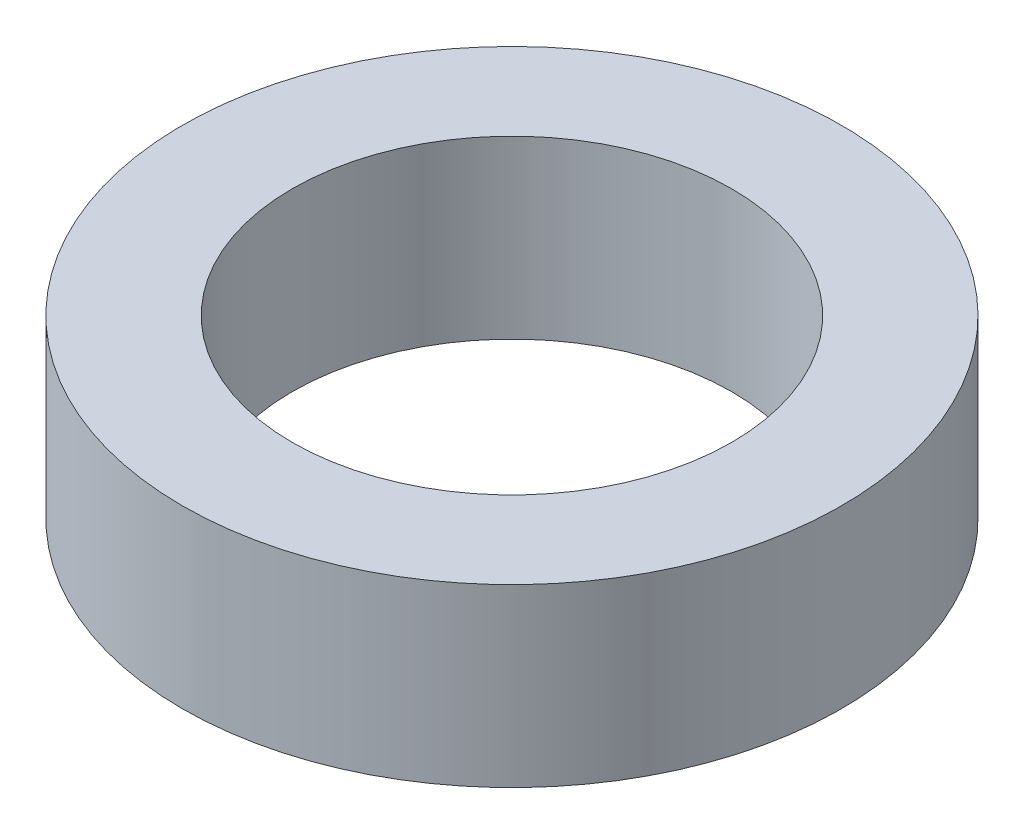
ISO-10303-21;
HEADER;
FILE_DESCRIPTION(('STEP AP214'),'2;1');
FILE_NAME('part.step','',(''),(''),'','','');
FILE_SCHEMA(('AUTOMOTIVE_DESIGN { 1 0 10303 214 1 1 1 1 }'));
ENDSEC;
DATA;
#1=APPLICATION_CONTEXT('core data for automotive mechanical design processes');
#2=APPLICATION_PROTOCOL_DEFINITION('international standard','automotive_design',2000,#1);
#3=PRODUCT_CONTEXT('',#1,'mechanical');
#4=PRODUCT('Part','Part','',(#3));
#5=PRODUCT_RELATED_PRODUCT_CATEGORY('part','',(#4));
#6=PRODUCT_DEFINITION_FORMATION('','',#4);
#7=PRODUCT_DEFINITION_CONTEXT('part definition',#1,'design');
#8=PRODUCT_DEFINITION('design','',#6,#7);
#9=PRODUCT_DEFINITION_SHAPE('','',#8);
#10=(LENGTH_UNIT() NAMED_UNIT(*) SI_UNIT(.MILLI.,.METRE.));
#11=(NAMED_UNIT(*) PLANE_ANGLE_UNIT() SI_UNIT($,.RADIAN.));
#12=(NAMED_UNIT(*) SI_UNIT($,.STERADIAN.) SOLID_ANGLE_UNIT());
#13=UNCERTAINTY_MEASURE_WITH_UNIT(LENGTH_MEASURE(1.E-05),#10,'distance_accuracy_value','');
#14=(GEOMETRIC_REPRESENTATION_CONTEXT(3) GLOBAL_UNCERTAINTY_ASSIGNED_CONTEXT((#13)) GLOBAL_UNIT_ASSIGNED_CONTEXT((#10,
#11,#12)) REPRESENTATION_CONTEXT('',''));
#15=CARTESIAN_POINT('',(0.,0.,0.));
#16=DIRECTION('',(0.,0.,1.));
#17=DIRECTION('',(1.,0.,0.));
#18=AXIS2_PLACEMENT_3D('',#15,#16,#17);
#19=CARTESIAN_POINT('',(0.,2.54,0.));
#20=DIRECTION('',(0.,1.,0.));
#21=DIRECTION('',(0.,0.,1.));
#22=AXIS2_PLACEMENT_3D('',#19,#20,#21);
#23=PLANE('',#22);
#24=CARTESIAN_POINT('',(0.,2.54,0.));
#25=DIRECTION('',(0.,1.,0.));
#26=DIRECTION('',(0.,0.,1.));
#27=AXIS2_PLACEMENT_3D('',#24,#25,#26);
#28=CIRCLE('',#27,4.7625);
#29=CARTESIAN_POINT('',(0.,2.54,4.7625));
#30=VERTEX_POINT('',#29);
#31=EDGE_CURVE('E10',#30,#30,#28,.T.);
#32=ORIENTED_EDGE('',*,*,#31,.T.);
#33=EDGE_LOOP('',(#32));
#34=FACE_BOUND('',#33,.T.);
#35=CARTESIAN_POINT('',(0.,2.54,0.));
#36=DIRECTION('',(0.,1.,0.));
#37=DIRECTION('',(0.,0.,1.));
#38=AXIS2_PLACEMENT_3D('',#35,#36,#37);
#39=CIRCLE('',#38,3.175);
#40=CARTESIAN_POINT('',(0.,2.54,3.175));
#41=VERTEX_POINT('',#40);
#42=EDGE_CURVE('E42',#41,#41,#39,.T.);
#43=ORIENTED_EDGE('',*,*,#42,.F.);
#44=EDGE_LOOP('',(#43));
#45=FACE_BOUND('',#44,.T.);
#46=ADVANCED_FACE('F31',(#34,#45),#23,.T.);
#47=CARTESIAN_POINT('',(0.,0.,0.));
#48=DIRECTION('',(0.,1.,0.));
#49=DIRECTION('',(0.,0.,1.));
#50=AXIS2_PLACEMENT_3D('',#47,#48,#49);
#51=PLANE('',#50);
#52=CARTESIAN_POINT('',(0.,0.,0.));
#53=DIRECTION('',(0.,1.,0.));
#54=DIRECTION('',(0.,0.,1.));
#55=AXIS2_PLACEMENT_3D('',#52,#53,#54);
#56=CIRCLE('',#55,4.7625);
#57=CARTESIAN_POINT('',(0.,0.,4.7625));
#58=VERTEX_POINT('',#57);
#59=EDGE_CURVE('E35',#58,#58,#56,.T.);
#60=ORIENTED_EDGE('',*,*,#59,.F.);
#61=EDGE_LOOP('',(#60));
#62=FACE_BOUND('',#61,.T.);
#63=CARTESIAN_POINT('',(0.,0.,0.));
#64=DIRECTION('',(0.,1.,0.));
#65=DIRECTION('',(0.,0.,1.));
#66=AXIS2_PLACEMENT_3D('',#63,#64,#65);
#67=CIRCLE('',#66,3.175);
#68=CARTESIAN_POINT('',(0.,0.,3.175));
#69=VERTEX_POINT('',#68);
#70=EDGE_CURVE('E44',#69,#69,#67,.T.);
#71=ORIENTED_EDGE('',*,*,#70,.T.);
#72=EDGE_LOOP('',(#71));
#73=FACE_BOUND('',#72,.T.);
#74=ADVANCED_FACE('F54',(#62,#73),#51,.F.);
#75=CARTESIAN_POINT('',(0.,2.54,0.));
#76=DIRECTION('',(0.,-1.,0.));
#77=DIRECTION('',(0.,0.,-1.));
#78=AXIS2_PLACEMENT_3D('',#75,#76,#77);
#79=CYLINDRICAL_SURFACE('',#78,4.7625);
#80=ORIENTED_EDGE('',*,*,#31,.F.);
#81=EDGE_LOOP('',(#80));
#82=FACE_BOUND('',#81,.T.);
#83=ORIENTED_EDGE('',*,*,#59,.T.);
#84=EDGE_LOOP('',(#83));
#85=FACE_BOUND('',#84,.T.);
#86=ADVANCED_FACE('F33',(#82,#85),#79,.T.);
#87=CARTESIAN_POINT('',(0.,2.54,0.));
#88=DIRECTION('',(0.,-1.,0.));
#89=DIRECTION('',(0.,0.,-1.));
#90=AXIS2_PLACEMENT_3D('',#87,#88,#89);
#91=CYLINDRICAL_SURFACE('',#90,3.175);
#92=ORIENTED_EDGE('',*,*,#42,.T.);
#93=EDGE_LOOP('',(#92));
#94=FACE_BOUND('',#93,.T.);
#95=ORIENTED_EDGE('',*,*,#70,.F.);
#96=EDGE_LOOP('',(#95));
#97=FACE_BOUND('',#96,.T.);
#98=ADVANCED_FACE('F50',(#94,#97),#91,.F.);
#99=CLOSED_SHELL('',(#46,#74,#86,#98));
#100=MANIFOLD_SOLID_BREP('B2',#99);
#101=ADVANCED_BREP_SHAPE_REPRESENTATION('',(#18,#100),#14);
#102=SHAPE_DEFINITION_REPRESENTATION(#9,#101);
ENDSEC;
END-ISO-10303-21;
